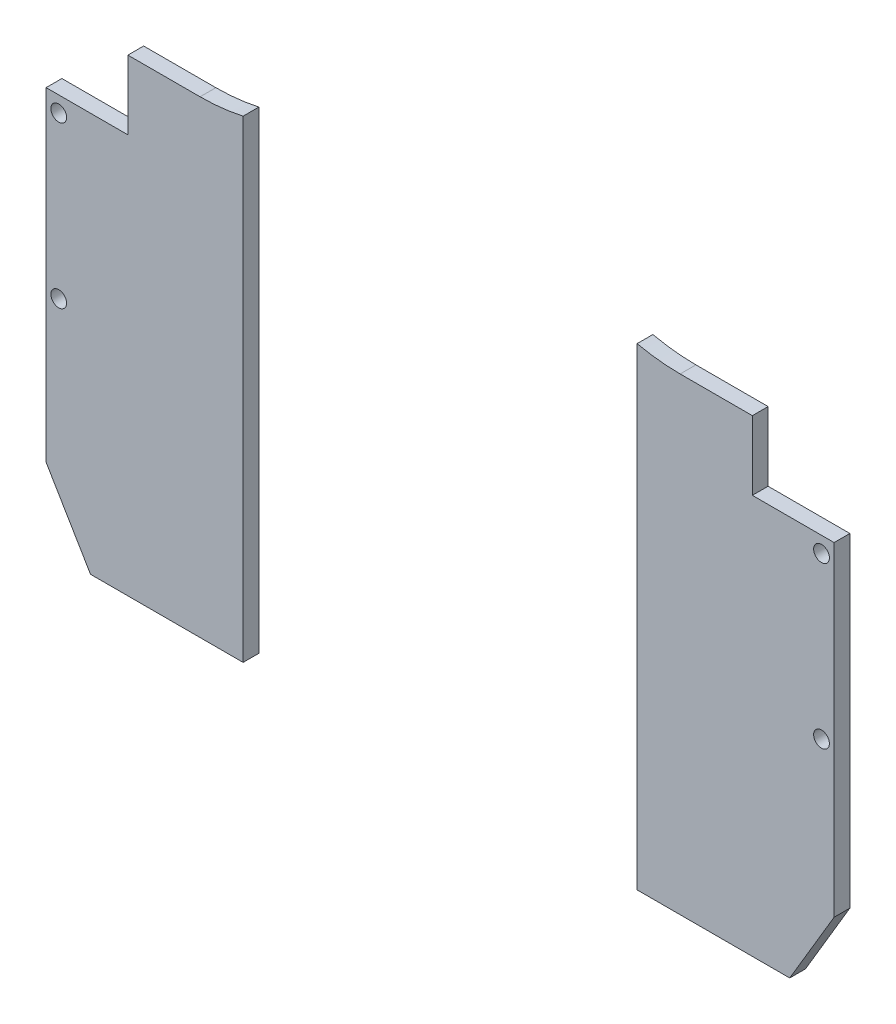
ISO-10303-21;
HEADER;
FILE_DESCRIPTION(('STEP AP214'),'2;1');
FILE_NAME('part.step','',(''),(''),'','','');
FILE_SCHEMA(('AUTOMOTIVE_DESIGN { 1 0 10303 214 1 1 1 1 }'));
ENDSEC;
DATA;
#1=APPLICATION_CONTEXT('core data for automotive mechanical design processes');
#2=APPLICATION_PROTOCOL_DEFINITION('international standard','automotive_design',2000,#1);
#3=PRODUCT_CONTEXT('',#1,'mechanical');
#4=PRODUCT('Part','Part','',(#3));
#5=PRODUCT_RELATED_PRODUCT_CATEGORY('part','',(#4));
#6=PRODUCT_DEFINITION_FORMATION('','',#4);
#7=PRODUCT_DEFINITION_CONTEXT('part definition',#1,'design');
#8=PRODUCT_DEFINITION('design','',#6,#7);
#9=PRODUCT_DEFINITION_SHAPE('','',#8);
#10=(LENGTH_UNIT() NAMED_UNIT(*) SI_UNIT(.MILLI.,.METRE.));
#11=(NAMED_UNIT(*) PLANE_ANGLE_UNIT() SI_UNIT($,.RADIAN.));
#12=(NAMED_UNIT(*) SI_UNIT($,.STERADIAN.) SOLID_ANGLE_UNIT());
#13=UNCERTAINTY_MEASURE_WITH_UNIT(LENGTH_MEASURE(1.E-05),#10,'distance_accuracy_value','');
#14=(GEOMETRIC_REPRESENTATION_CONTEXT(3) GLOBAL_UNCERTAINTY_ASSIGNED_CONTEXT((#13)) GLOBAL_UNIT_ASSIGNED_CONTEXT((#10,
#11,#12)) REPRESENTATION_CONTEXT('',''));
#15=CARTESIAN_POINT('',(0.,0.,0.));
#16=DIRECTION('',(0.,0.,1.));
#17=DIRECTION('',(1.,0.,0.));
#18=AXIS2_PLACEMENT_3D('',#15,#16,#17);
#19=CARTESIAN_POINT('',(0.,0.,5.));
#20=DIRECTION('',(0.,0.,1.));
#21=DIRECTION('',(1.,0.,0.));
#22=AXIS2_PLACEMENT_3D('',#19,#20,#21);
#23=PLANE('',#22);
#24=DIRECTION('',(0.,1.,0.));
#25=VECTOR('',#24,1.);
#26=CARTESIAN_POINT('',(-3305.54194954562,-66.9191820934981,5.));
#27=LINE('',#26,#25);
#28=CARTESIAN_POINT('',(-3305.54194954562,-288.004845850017,5.));
#29=VERTEX_POINT('',#28);
#30=CARTESIAN_POINT('',(-3305.54194954562,-137.908903834425,5.));
#31=VERTEX_POINT('',#30);
#32=EDGE_CURVE('E51',#29,#31,#27,.T.);
#33=ORIENTED_EDGE('',*,*,#32,.F.);
#34=DIRECTION('',(1.,0.,0.));
#35=VECTOR('',#34,1.);
#36=CARTESIAN_POINT('',(-3493.04194954562,-288.004845850017,5.));
#37=LINE('',#36,#35);
#38=CARTESIAN_POINT('',(-3257.12544648731,-288.004845850017,5.));
#39=VERTEX_POINT('',#38);
#40=EDGE_CURVE('E147',#29,#39,#37,.T.);
#41=ORIENTED_EDGE('',*,*,#40,.T.);
#42=DIRECTION('',(-0.510309234892407,-0.859990979477998,0.));
#43=VECTOR('',#42,1.);
#44=CARTESIAN_POINT('',(-3243.04194954562,-264.270843991495,5.));
#45=LINE('',#44,#43);
#46=CARTESIAN_POINT('',(-3243.04194954562,-264.270843991495,5.));
#47=VERTEX_POINT('',#46);
#48=EDGE_CURVE('E137',#47,#39,#45,.T.);
#49=ORIENTED_EDGE('',*,*,#48,.F.);
#50=DIRECTION('',(0.,1.,0.));
#51=VECTOR('',#50,1.);
#52=CARTESIAN_POINT('',(-3243.04194954562,-66.9191820934981,5.));
#53=LINE('',#52,#51);
#54=CARTESIAN_POINT('',(-3243.04194954562,-161.319182093498,5.));
#55=VERTEX_POINT('',#54);
#56=EDGE_CURVE('E148',#47,#55,#53,.T.);
#57=ORIENTED_EDGE('',*,*,#56,.T.);
#58=DIRECTION('',(1.,0.,0.));
#59=VECTOR('',#58,1.);
#60=CARTESIAN_POINT('',(-3243.04194954562,-161.319182093498,5.));
#61=LINE('',#60,#59);
#62=CARTESIAN_POINT('',(-3268.98194954562,-161.319182093498,5.));
#63=VERTEX_POINT('',#62);
#64=EDGE_CURVE('E168',#63,#55,#61,.T.);
#65=ORIENTED_EDGE('',*,*,#64,.F.);
#66=DIRECTION('',(0.,-1.,0.));
#67=VECTOR('',#66,1.);
#68=CARTESIAN_POINT('',(-3268.98194954562,-161.319182093498,5.));
#69=LINE('',#68,#67);
#70=CARTESIAN_POINT('',(-3268.98194954562,-139.419182093498,5.));
#71=VERTEX_POINT('',#70);
#72=EDGE_CURVE('E165',#71,#63,#69,.T.);
#73=ORIENTED_EDGE('',*,*,#72,.F.);
#74=DIRECTION('',(1.,0.,0.));
#75=VECTOR('',#74,1.);
#76=CARTESIAN_POINT('',(-3268.98194954562,-139.419182093498,5.));
#77=LINE('',#76,#75);
#78=CARTESIAN_POINT('',(-3291.88530859829,-139.419182093498,5.));
#79=VERTEX_POINT('',#78);
#80=EDGE_CURVE('E120',#79,#71,#77,.T.);
#81=ORIENTED_EDGE('',*,*,#80,.F.);
#82=CARTESIAN_POINT('',(-3291.88530859829,-76.9191820934981,5.));
#83=DIRECTION('',(0.,0.,1.));
#84=DIRECTION('',(-1.,0.,0.));
#85=AXIS2_PLACEMENT_3D('',#82,#83,#84);
#86=CIRCLE('',#85,62.4999999999999);
#87=EDGE_CURVE('E114',#31,#79,#86,.T.);
#88=ORIENTED_EDGE('',*,*,#87,.F.);
#89=EDGE_LOOP('',(#33,#41,#49,#57,#65,#73,#81,#88));
#90=FACE_BOUND('',#89,.T.);
#91=CARTESIAN_POINT('',(-3247.04194954562,-217.319182093498,5.));
#92=DIRECTION('',(0.,0.,1.));
#93=DIRECTION('',(-1.,0.,0.));
#94=AXIS2_PLACEMENT_3D('',#91,#92,#93);
#95=CIRCLE('',#94,2.50000000000012);
#96=CARTESIAN_POINT('',(-3249.54194954562,-217.319182093498,5.));
#97=VERTEX_POINT('',#96);
#98=EDGE_CURVE('E122',#97,#97,#95,.T.);
#99=ORIENTED_EDGE('',*,*,#98,.F.);
#100=EDGE_LOOP('',(#99));
#101=FACE_BOUND('',#100,.T.);
#102=CARTESIAN_POINT('',(-3247.04194954562,-166.319182093498,5.));
#103=DIRECTION('',(0.,0.,1.));
#104=DIRECTION('',(-1.,0.,0.));
#105=AXIS2_PLACEMENT_3D('',#102,#103,#104);
#106=CIRCLE('',#105,2.50000000000012);
#107=CARTESIAN_POINT('',(-3249.54194954562,-166.319182093498,5.));
#108=VERTEX_POINT('',#107);
#109=EDGE_CURVE('E126',#108,#108,#106,.T.);
#110=ORIENTED_EDGE('',*,*,#109,.F.);
#111=EDGE_LOOP('',(#110));
#112=FACE_BOUND('',#111,.T.);
#113=ADVANCED_FACE('F43',(#90,#101,#112),#23,.T.);
#114=CARTESIAN_POINT('',(0.,0.,0.));
#115=DIRECTION('',(0.,0.,1.));
#116=DIRECTION('',(1.,0.,0.));
#117=AXIS2_PLACEMENT_3D('',#114,#115,#116);
#118=PLANE('',#117);
#119=CARTESIAN_POINT('',(-3247.04194954562,-166.319182093498,0.));
#120=DIRECTION('',(0.,0.,1.));
#121=DIRECTION('',(-1.,0.,0.));
#122=AXIS2_PLACEMENT_3D('',#119,#120,#121);
#123=CIRCLE('',#122,2.50000000000012);
#124=CARTESIAN_POINT('',(-3249.54194954562,-166.319182093498,0.));
#125=VERTEX_POINT('',#124);
#126=EDGE_CURVE('E151',#125,#125,#123,.T.);
#127=ORIENTED_EDGE('',*,*,#126,.T.);
#128=EDGE_LOOP('',(#127));
#129=FACE_BOUND('',#128,.T.);
#130=CARTESIAN_POINT('',(-3247.04194954562,-217.319182093498,0.));
#131=DIRECTION('',(0.,0.,1.));
#132=DIRECTION('',(-1.,0.,0.));
#133=AXIS2_PLACEMENT_3D('',#130,#131,#132);
#134=CIRCLE('',#133,2.50000000000012);
#135=CARTESIAN_POINT('',(-3249.54194954562,-217.319182093498,0.));
#136=VERTEX_POINT('',#135);
#137=EDGE_CURVE('E146',#136,#136,#134,.T.);
#138=ORIENTED_EDGE('',*,*,#137,.T.);
#139=EDGE_LOOP('',(#138));
#140=FACE_BOUND('',#139,.T.);
#141=DIRECTION('',(1.,0.,0.));
#142=VECTOR('',#141,1.);
#143=CARTESIAN_POINT('',(-3493.04194954562,-288.004845850017,0.));
#144=LINE('',#143,#142);
#145=CARTESIAN_POINT('',(-3305.54194954562,-288.004845850017,0.));
#146=VERTEX_POINT('',#145);
#147=CARTESIAN_POINT('',(-3257.12544648731,-288.004845850017,0.));
#148=VERTEX_POINT('',#147);
#149=EDGE_CURVE('E46',#146,#148,#144,.T.);
#150=ORIENTED_EDGE('',*,*,#149,.F.);
#151=DIRECTION('',(0.,1.,0.));
#152=VECTOR('',#151,1.);
#153=CARTESIAN_POINT('',(-3305.54194954562,-66.9191820934981,0.));
#154=LINE('',#153,#152);
#155=CARTESIAN_POINT('',(-3305.54194954562,-137.908903834425,0.));
#156=VERTEX_POINT('',#155);
#157=EDGE_CURVE('E63',#146,#156,#154,.T.);
#158=ORIENTED_EDGE('',*,*,#157,.T.);
#159=CARTESIAN_POINT('',(-3291.88530859829,-76.9191820934981,0.));
#160=DIRECTION('',(0.,0.,1.));
#161=DIRECTION('',(-1.,0.,0.));
#162=AXIS2_PLACEMENT_3D('',#159,#160,#161);
#163=CIRCLE('',#162,62.4999999999999);
#164=CARTESIAN_POINT('',(-3291.88530859829,-139.419182093498,0.));
#165=VERTEX_POINT('',#164);
#166=EDGE_CURVE('E116',#156,#165,#163,.T.);
#167=ORIENTED_EDGE('',*,*,#166,.T.);
#168=DIRECTION('',(1.,0.,0.));
#169=VECTOR('',#168,1.);
#170=CARTESIAN_POINT('',(-3268.98194954562,-139.419182093498,0.));
#171=LINE('',#170,#169);
#172=CARTESIAN_POINT('',(-3268.98194954562,-139.419182093498,0.));
#173=VERTEX_POINT('',#172);
#174=EDGE_CURVE('E175',#165,#173,#171,.T.);
#175=ORIENTED_EDGE('',*,*,#174,.T.);
#176=DIRECTION('',(0.,-1.,0.));
#177=VECTOR('',#176,1.);
#178=CARTESIAN_POINT('',(-3268.98194954562,-161.319182093498,0.));
#179=LINE('',#178,#177);
#180=CARTESIAN_POINT('',(-3268.98194954562,-161.319182093498,0.));
#181=VERTEX_POINT('',#180);
#182=EDGE_CURVE('E172',#173,#181,#179,.T.);
#183=ORIENTED_EDGE('',*,*,#182,.T.);
#184=DIRECTION('',(1.,0.,0.));
#185=VECTOR('',#184,1.);
#186=CARTESIAN_POINT('',(-3243.04194954562,-161.319182093498,0.));
#187=LINE('',#186,#185);
#188=CARTESIAN_POINT('',(-3243.04194954562,-161.319182093498,0.));
#189=VERTEX_POINT('',#188);
#190=EDGE_CURVE('E141',#181,#189,#187,.T.);
#191=ORIENTED_EDGE('',*,*,#190,.T.);
#192=DIRECTION('',(0.,1.,0.));
#193=VECTOR('',#192,1.);
#194=CARTESIAN_POINT('',(-3243.04194954562,-66.9191820934981,0.));
#195=LINE('',#194,#193);
#196=CARTESIAN_POINT('',(-3243.04194954562,-264.270843991495,0.));
#197=VERTEX_POINT('',#196);
#198=EDGE_CURVE('E134',#197,#189,#195,.T.);
#199=ORIENTED_EDGE('',*,*,#198,.F.);
#200=DIRECTION('',(-0.510309234892407,-0.859990979477998,0.));
#201=VECTOR('',#200,1.);
#202=CARTESIAN_POINT('',(-3243.04194954562,-264.270843991495,0.));
#203=LINE('',#202,#201);
#204=EDGE_CURVE('E138',#197,#148,#203,.T.);
#205=ORIENTED_EDGE('',*,*,#204,.T.);
#206=EDGE_LOOP('',(#150,#158,#167,#175,#183,#191,#199,#205));
#207=FACE_BOUND('',#206,.T.);
#208=ADVANCED_FACE('F192',(#129,#140,#207),#118,.F.);
#209=CARTESIAN_POINT('',(-3493.04194954562,-288.004845850017,5.));
#210=DIRECTION('',(0.,1.,0.));
#211=DIRECTION('',(-1.,0.,0.));
#212=AXIS2_PLACEMENT_3D('',#209,#210,#211);
#213=PLANE('',#212);
#214=ORIENTED_EDGE('',*,*,#40,.F.);
#215=DIRECTION('',(0.,0.,-1.));
#216=VECTOR('',#215,1.);
#217=CARTESIAN_POINT('',(-3305.54194954562,-288.004845850017,5.));
#218=LINE('',#217,#216);
#219=EDGE_CURVE('E59',#29,#146,#218,.T.);
#220=ORIENTED_EDGE('',*,*,#219,.T.);
#221=ORIENTED_EDGE('',*,*,#149,.T.);
#222=DIRECTION('',(0.,0.,-1.));
#223=VECTOR('',#222,1.);
#224=CARTESIAN_POINT('',(-3257.12544648731,-288.004845850017,5.));
#225=LINE('',#224,#223);
#226=EDGE_CURVE('E108',#39,#148,#225,.T.);
#227=ORIENTED_EDGE('',*,*,#226,.F.);
#228=EDGE_LOOP('',(#214,#220,#221,#227));
#229=FACE_BOUND('',#228,.T.);
#230=ADVANCED_FACE('F209',(#229),#213,.F.);
#231=CARTESIAN_POINT('',(-3243.04194954562,-66.9191820934981,5.));
#232=DIRECTION('',(-1.,0.,0.));
#233=DIRECTION('',(0.,0.,1.));
#234=AXIS2_PLACEMENT_3D('',#231,#232,#233);
#235=PLANE('',#234);
#236=DIRECTION('',(0.,0.,-1.));
#237=VECTOR('',#236,1.);
#238=CARTESIAN_POINT('',(-3243.04194954562,-161.319182093498,5.));
#239=LINE('',#238,#237);
#240=EDGE_CURVE('E144',#55,#189,#239,.T.);
#241=ORIENTED_EDGE('',*,*,#240,.F.);
#242=ORIENTED_EDGE('',*,*,#56,.F.);
#243=DIRECTION('',(0.,0.,-1.));
#244=VECTOR('',#243,1.);
#245=CARTESIAN_POINT('',(-3243.04194954562,-264.270843991495,5.));
#246=LINE('',#245,#244);
#247=EDGE_CURVE('E131',#47,#197,#246,.T.);
#248=ORIENTED_EDGE('',*,*,#247,.T.);
#249=ORIENTED_EDGE('',*,*,#198,.T.);
#250=EDGE_LOOP('',(#241,#242,#248,#249));
#251=FACE_BOUND('',#250,.T.);
#252=ADVANCED_FACE('F214',(#251),#235,.F.);
#253=CARTESIAN_POINT('',(-3247.04194954562,-166.319182093498,5.));
#254=DIRECTION('',(0.,0.,-1.));
#255=DIRECTION('',(-1.,0.,0.));
#256=AXIS2_PLACEMENT_3D('',#253,#254,#255);
#257=CYLINDRICAL_SURFACE('',#256,2.50000000000012);
#258=ORIENTED_EDGE('',*,*,#109,.T.);
#259=EDGE_LOOP('',(#258));
#260=FACE_BOUND('',#259,.T.);
#261=ORIENTED_EDGE('',*,*,#126,.F.);
#262=EDGE_LOOP('',(#261));
#263=FACE_BOUND('',#262,.T.);
#264=ADVANCED_FACE('F265',(#260,#263),#257,.F.);
#265=CARTESIAN_POINT('',(-3247.04194954562,-217.319182093498,5.));
#266=DIRECTION('',(0.,0.,-1.));
#267=DIRECTION('',(-1.,0.,0.));
#268=AXIS2_PLACEMENT_3D('',#265,#266,#267);
#269=CYLINDRICAL_SURFACE('',#268,2.50000000000012);
#270=ORIENTED_EDGE('',*,*,#98,.T.);
#271=EDGE_LOOP('',(#270));
#272=FACE_BOUND('',#271,.T.);
#273=ORIENTED_EDGE('',*,*,#137,.F.);
#274=EDGE_LOOP('',(#273));
#275=FACE_BOUND('',#274,.T.);
#276=ADVANCED_FACE('F203',(#272,#275),#269,.F.);
#277=CARTESIAN_POINT('',(-3291.88530859829,-76.9191820934981,5.));
#278=DIRECTION('',(0.,0.,-1.));
#279=DIRECTION('',(-1.,0.,0.));
#280=AXIS2_PLACEMENT_3D('',#277,#278,#279);
#281=CYLINDRICAL_SURFACE('',#280,62.4999999999999);
#282=DIRECTION('',(0.,0.,-1.));
#283=VECTOR('',#282,1.);
#284=CARTESIAN_POINT('',(-3305.54194954562,-137.908903834425,5.));
#285=LINE('',#284,#283);
#286=EDGE_CURVE('E12',#31,#156,#285,.T.);
#287=ORIENTED_EDGE('',*,*,#286,.F.);
#288=ORIENTED_EDGE('',*,*,#87,.T.);
#289=DIRECTION('',(0.,0.,-1.));
#290=VECTOR('',#289,1.);
#291=CARTESIAN_POINT('',(-3291.88530859829,-139.419182093498,5.));
#292=LINE('',#291,#290);
#293=EDGE_CURVE('E121',#79,#165,#292,.T.);
#294=ORIENTED_EDGE('',*,*,#293,.T.);
#295=ORIENTED_EDGE('',*,*,#166,.F.);
#296=EDGE_LOOP('',(#287,#288,#294,#295));
#297=FACE_BOUND('',#296,.T.);
#298=ADVANCED_FACE('F112',(#297),#281,.F.);
#299=CARTESIAN_POINT('',(-3268.98194954562,-139.419182093498,5.));
#300=DIRECTION('',(0.,1.,0.));
#301=DIRECTION('',(-1.,0.,0.));
#302=AXIS2_PLACEMENT_3D('',#299,#300,#301);
#303=PLANE('',#302);
#304=ORIENTED_EDGE('',*,*,#174,.F.);
#305=ORIENTED_EDGE('',*,*,#293,.F.);
#306=ORIENTED_EDGE('',*,*,#80,.T.);
#307=DIRECTION('',(0.,0.,-1.));
#308=VECTOR('',#307,1.);
#309=CARTESIAN_POINT('',(-3268.98194954562,-139.419182093498,5.));
#310=LINE('',#309,#308);
#311=EDGE_CURVE('E163',#71,#173,#310,.T.);
#312=ORIENTED_EDGE('',*,*,#311,.T.);
#313=EDGE_LOOP('',(#304,#305,#306,#312));
#314=FACE_BOUND('',#313,.T.);
#315=ADVANCED_FACE('F195',(#314),#303,.T.);
#316=CARTESIAN_POINT('',(-3268.98194954562,-161.319182093498,5.));
#317=DIRECTION('',(1.,0.,0.));
#318=DIRECTION('',(0.,0.,-1.));
#319=AXIS2_PLACEMENT_3D('',#316,#317,#318);
#320=PLANE('',#319);
#321=ORIENTED_EDGE('',*,*,#182,.F.);
#322=ORIENTED_EDGE('',*,*,#311,.F.);
#323=ORIENTED_EDGE('',*,*,#72,.T.);
#324=DIRECTION('',(0.,0.,-1.));
#325=VECTOR('',#324,1.);
#326=CARTESIAN_POINT('',(-3268.98194954562,-161.319182093498,5.));
#327=LINE('',#326,#325);
#328=EDGE_CURVE('E166',#63,#181,#327,.T.);
#329=ORIENTED_EDGE('',*,*,#328,.T.);
#330=EDGE_LOOP('',(#321,#322,#323,#329));
#331=FACE_BOUND('',#330,.T.);
#332=ADVANCED_FACE('F183',(#331),#320,.T.);
#333=CARTESIAN_POINT('',(-3243.04194954562,-161.319182093498,5.));
#334=DIRECTION('',(0.,1.,0.));
#335=DIRECTION('',(-1.,0.,0.));
#336=AXIS2_PLACEMENT_3D('',#333,#334,#335);
#337=PLANE('',#336);
#338=ORIENTED_EDGE('',*,*,#190,.F.);
#339=ORIENTED_EDGE('',*,*,#328,.F.);
#340=ORIENTED_EDGE('',*,*,#64,.T.);
#341=ORIENTED_EDGE('',*,*,#240,.T.);
#342=EDGE_LOOP('',(#338,#339,#340,#341));
#343=FACE_BOUND('',#342,.T.);
#344=ADVANCED_FACE('F186',(#343),#337,.T.);
#345=CARTESIAN_POINT('',(-3243.04194954562,-264.270843991495,5.));
#346=DIRECTION('',(0.859990979477998,-0.510309234892407,0.));
#347=DIRECTION('',(0.510309234892407,0.859990979477998,0.));
#348=AXIS2_PLACEMENT_3D('',#345,#346,#347);
#349=PLANE('',#348);
#350=ORIENTED_EDGE('',*,*,#204,.F.);
#351=ORIENTED_EDGE('',*,*,#247,.F.);
#352=ORIENTED_EDGE('',*,*,#48,.T.);
#353=ORIENTED_EDGE('',*,*,#226,.T.);
#354=EDGE_LOOP('',(#350,#351,#352,#353));
#355=FACE_BOUND('',#354,.T.);
#356=ADVANCED_FACE('F221',(#355),#349,.T.);
#357=CARTESIAN_POINT('',(-3305.54194954562,-66.9191820934981,0.));
#358=DIRECTION('',(1.,0.,0.));
#359=DIRECTION('',(0.,1.,0.));
#360=AXIS2_PLACEMENT_3D('',#357,#358,#359);
#361=PLANE('',#360);
#362=ORIENTED_EDGE('',*,*,#32,.T.);
#363=ORIENTED_EDGE('',*,*,#286,.T.);
#364=ORIENTED_EDGE('',*,*,#157,.F.);
#365=ORIENTED_EDGE('',*,*,#219,.F.);
#366=EDGE_LOOP('',(#362,#363,#364,#365));
#367=FACE_BOUND('',#366,.T.);
#368=ADVANCED_FACE('F104',(#367),#361,.F.);
#369=CLOSED_SHELL('',(#113,#208,#230,#252,#264,#276,#298,#315,#332,#344,#356,#368));
#370=MANIFOLD_SOLID_BREP('B2',#369);
#371=CARTESIAN_POINT('',(-3467.10194954562,-161.319182093498,5.));
#372=DIRECTION('',(-1.,0.,0.));
#373=DIRECTION('',(0.,0.,1.));
#374=AXIS2_PLACEMENT_3D('',#371,#372,#373);
#375=PLANE('',#374);
#376=DIRECTION('',(0.,1.,0.));
#377=VECTOR('',#376,1.);
#378=CARTESIAN_POINT('',(-3467.10194954562,-161.319182093498,0.));
#379=LINE('',#378,#377);
#380=CARTESIAN_POINT('',(-3467.10194954562,-161.319182093498,0.));
#381=VERTEX_POINT('',#380);
#382=CARTESIAN_POINT('',(-3467.10194954562,-139.419182093498,0.));
#383=VERTEX_POINT('',#382);
#384=EDGE_CURVE('E407',#381,#383,#379,.T.);
#385=ORIENTED_EDGE('',*,*,#384,.F.);
#386=DIRECTION('',(0.,0.,-1.));
#387=VECTOR('',#386,1.);
#388=CARTESIAN_POINT('',(-3467.10194954562,-161.319182093498,5.));
#389=LINE('',#388,#387);
#390=CARTESIAN_POINT('',(-3467.10194954562,-161.319182093498,5.));
#391=VERTEX_POINT('',#390);
#392=EDGE_CURVE('E420',#391,#381,#389,.T.);
#393=ORIENTED_EDGE('',*,*,#392,.F.);
#394=DIRECTION('',(0.,1.,0.));
#395=VECTOR('',#394,1.);
#396=CARTESIAN_POINT('',(-3467.10194954562,-161.319182093498,5.));
#397=LINE('',#396,#395);
#398=CARTESIAN_POINT('',(-3467.10194954562,-139.419182093498,5.));
#399=VERTEX_POINT('',#398);
#400=EDGE_CURVE('E400',#391,#399,#397,.T.);
#401=ORIENTED_EDGE('',*,*,#400,.T.);
#402=DIRECTION('',(0.,0.,-1.));
#403=VECTOR('',#402,1.);
#404=CARTESIAN_POINT('',(-3467.10194954562,-139.419182093498,5.));
#405=LINE('',#404,#403);
#406=EDGE_CURVE('E418',#399,#383,#405,.T.);
#407=ORIENTED_EDGE('',*,*,#406,.T.);
#408=EDGE_LOOP('',(#385,#393,#401,#407));
#409=FACE_BOUND('',#408,.T.);
#410=ADVANCED_FACE('F313',(#409),#375,.T.);
#411=CARTESIAN_POINT('',(-3493.04194954562,-161.319182093498,5.));
#412=DIRECTION('',(0.,1.,0.));
#413=DIRECTION('',(0.,0.,1.));
#414=AXIS2_PLACEMENT_3D('',#411,#412,#413);
#415=PLANE('',#414);
#416=DIRECTION('',(1.,0.,0.));
#417=VECTOR('',#416,1.);
#418=CARTESIAN_POINT('',(-3493.04194954562,-161.319182093498,0.));
#419=LINE('',#418,#417);
#420=CARTESIAN_POINT('',(-3493.04194954562,-161.319182093498,0.));
#421=VERTEX_POINT('',#420);
#422=EDGE_CURVE('E404',#421,#381,#419,.T.);
#423=ORIENTED_EDGE('',*,*,#422,.F.);
#424=DIRECTION('',(0.,0.,-1.));
#425=VECTOR('',#424,1.);
#426=CARTESIAN_POINT('',(-3493.04194954562,-161.319182093498,5.));
#427=LINE('',#426,#425);
#428=CARTESIAN_POINT('',(-3493.04194954562,-161.319182093498,5.));
#429=VERTEX_POINT('',#428);
#430=EDGE_CURVE('E395',#429,#421,#427,.T.);
#431=ORIENTED_EDGE('',*,*,#430,.F.);
#432=DIRECTION('',(1.,0.,0.));
#433=VECTOR('',#432,1.);
#434=CARTESIAN_POINT('',(-3493.04194954562,-161.319182093498,5.));
#435=LINE('',#434,#433);
#436=EDGE_CURVE('E415',#429,#391,#435,.T.);
#437=ORIENTED_EDGE('',*,*,#436,.T.);
#438=ORIENTED_EDGE('',*,*,#392,.T.);
#439=EDGE_LOOP('',(#423,#431,#437,#438));
#440=FACE_BOUND('',#439,.T.);
#441=ADVANCED_FACE('F468',(#440),#415,.T.);
#442=CARTESIAN_POINT('',(-3493.04194954562,-66.9191820934982,5.));
#443=DIRECTION('',(1.,0.,0.));
#444=DIRECTION('',(0.,0.,-1.));
#445=AXIS2_PLACEMENT_3D('',#442,#443,#444);
#446=PLANE('',#445);
#447=DIRECTION('',(0.,0.,-1.));
#448=VECTOR('',#447,1.);
#449=CARTESIAN_POINT('',(-3493.04194954562,-264.270843991495,5.));
#450=LINE('',#449,#448);
#451=CARTESIAN_POINT('',(-3493.04194954562,-264.270843991495,5.));
#452=VERTEX_POINT('',#451);
#453=CARTESIAN_POINT('',(-3493.04194954562,-264.270843991495,0.));
#454=VERTEX_POINT('',#453);
#455=EDGE_CURVE('E455',#452,#454,#450,.T.);
#456=ORIENTED_EDGE('',*,*,#455,.F.);
#457=DIRECTION('',(0.,-1.,0.));
#458=VECTOR('',#457,1.);
#459=CARTESIAN_POINT('',(-3493.04194954562,-66.9191820934982,5.));
#460=LINE('',#459,#458);
#461=EDGE_CURVE('E436',#429,#452,#460,.T.);
#462=ORIENTED_EDGE('',*,*,#461,.F.);
#463=ORIENTED_EDGE('',*,*,#430,.T.);
#464=DIRECTION('',(0.,-1.,0.));
#465=VECTOR('',#464,1.);
#466=CARTESIAN_POINT('',(-3493.04194954562,-66.9191820934982,0.));
#467=LINE('',#466,#465);
#468=EDGE_CURVE('E433',#421,#454,#467,.T.);
#469=ORIENTED_EDGE('',*,*,#468,.T.);
#470=EDGE_LOOP('',(#456,#462,#463,#469));
#471=FACE_BOUND('',#470,.T.);
#472=ADVANCED_FACE('F315',(#471),#446,.F.);
#473=CARTESIAN_POINT('',(-3489.04194954562,-217.319182093498,5.));
#474=DIRECTION('',(0.,0.,-1.));
#475=DIRECTION('',(-1.,0.,0.));
#476=AXIS2_PLACEMENT_3D('',#473,#474,#475);
#477=CYLINDRICAL_SURFACE('',#476,2.50000000000012);
#478=CARTESIAN_POINT('',(-3489.04194954562,-217.319182093498,5.));
#479=DIRECTION('',(0.,0.,1.));
#480=DIRECTION('',(1.,0.,0.));
#481=AXIS2_PLACEMENT_3D('',#478,#479,#480);
#482=CIRCLE('',#481,2.50000000000012);
#483=CARTESIAN_POINT('',(-3486.54194954562,-217.319182093498,5.));
#484=VERTEX_POINT('',#483);
#485=EDGE_CURVE('E430',#484,#484,#482,.T.);
#486=ORIENTED_EDGE('',*,*,#485,.T.);
#487=EDGE_LOOP('',(#486));
#488=FACE_BOUND('',#487,.T.);
#489=CARTESIAN_POINT('',(-3489.04194954562,-217.319182093498,0.));
#490=DIRECTION('',(0.,0.,1.));
#491=DIRECTION('',(1.,0.,0.));
#492=AXIS2_PLACEMENT_3D('',#489,#490,#491);
#493=CIRCLE('',#492,2.50000000000012);
#494=CARTESIAN_POINT('',(-3486.54194954562,-217.319182093498,0.));
#495=VERTEX_POINT('',#494);
#496=EDGE_CURVE('E427',#495,#495,#493,.T.);
#497=ORIENTED_EDGE('',*,*,#496,.F.);
#498=EDGE_LOOP('',(#497));
#499=FACE_BOUND('',#498,.T.);
#500=ADVANCED_FACE('F481',(#488,#499),#477,.F.);
#501=CARTESIAN_POINT('',(-3489.04194954562,-166.319182093498,5.));
#502=DIRECTION('',(0.,0.,-1.));
#503=DIRECTION('',(-1.,0.,0.));
#504=AXIS2_PLACEMENT_3D('',#501,#502,#503);
#505=CYLINDRICAL_SURFACE('',#504,2.50000000000012);
#506=CARTESIAN_POINT('',(-3489.04194954562,-166.319182093498,5.));
#507=DIRECTION('',(0.,0.,1.));
#508=DIRECTION('',(1.,0.,0.));
#509=AXIS2_PLACEMENT_3D('',#506,#507,#508);
#510=CIRCLE('',#509,2.50000000000012);
#511=CARTESIAN_POINT('',(-3486.54194954562,-166.319182093498,5.));
#512=VERTEX_POINT('',#511);
#513=EDGE_CURVE('E424',#512,#512,#510,.T.);
#514=ORIENTED_EDGE('',*,*,#513,.T.);
#515=EDGE_LOOP('',(#514));
#516=FACE_BOUND('',#515,.T.);
#517=CARTESIAN_POINT('',(-3489.04194954562,-166.319182093498,0.));
#518=DIRECTION('',(0.,0.,1.));
#519=DIRECTION('',(1.,0.,0.));
#520=AXIS2_PLACEMENT_3D('',#517,#518,#519);
#521=CIRCLE('',#520,2.50000000000012);
#522=CARTESIAN_POINT('',(-3486.54194954562,-166.319182093498,0.));
#523=VERTEX_POINT('',#522);
#524=EDGE_CURVE('E423',#523,#523,#521,.T.);
#525=ORIENTED_EDGE('',*,*,#524,.F.);
#526=EDGE_LOOP('',(#525));
#527=FACE_BOUND('',#526,.T.);
#528=ADVANCED_FACE('F474',(#516,#527),#505,.F.);
#529=CARTESIAN_POINT('',(-3493.04194954562,-264.270843991495,5.));
#530=DIRECTION('',(-0.859990979477998,-0.510309234892407,0.));
#531=DIRECTION('',(0.510309234892407,-0.859990979477998,0.));
#532=AXIS2_PLACEMENT_3D('',#529,#530,#531);
#533=PLANE('',#532);
#534=DIRECTION('',(-0.510309234892407,0.859990979477998,0.));
#535=VECTOR('',#534,1.);
#536=CARTESIAN_POINT('',(-3493.04194954562,-264.270843991495,0.));
#537=LINE('',#536,#535);
#538=CARTESIAN_POINT('',(-3478.95845260393,-288.004845850017,0.));
#539=VERTEX_POINT('',#538);
#540=EDGE_CURVE('E335',#539,#454,#537,.T.);
#541=ORIENTED_EDGE('',*,*,#540,.F.);
#542=DIRECTION('',(0.,0.,-1.));
#543=VECTOR('',#542,1.);
#544=CARTESIAN_POINT('',(-3478.95845260393,-288.004845850017,5.));
#545=LINE('',#544,#543);
#546=CARTESIAN_POINT('',(-3478.95845260393,-288.004845850017,5.));
#547=VERTEX_POINT('',#546);
#548=EDGE_CURVE('E408',#547,#539,#545,.T.);
#549=ORIENTED_EDGE('',*,*,#548,.F.);
#550=DIRECTION('',(-0.510309234892407,0.859990979477998,0.));
#551=VECTOR('',#550,1.);
#552=CARTESIAN_POINT('',(-3493.04194954562,-264.270843991495,5.));
#553=LINE('',#552,#551);
#554=EDGE_CURVE('E453',#547,#452,#553,.T.);
#555=ORIENTED_EDGE('',*,*,#554,.T.);
#556=ORIENTED_EDGE('',*,*,#455,.T.);
#557=EDGE_LOOP('',(#541,#549,#555,#556));
#558=FACE_BOUND('',#557,.T.);
#559=ADVANCED_FACE('F472',(#558),#533,.T.);
#560=CARTESIAN_POINT('',(-3467.10194954562,-139.419182093498,5.));
#561=DIRECTION('',(0.,1.,0.));
#562=DIRECTION('',(-1.,0.,0.));
#563=AXIS2_PLACEMENT_3D('',#560,#561,#562);
#564=PLANE('',#563);
#565=DIRECTION('',(1.,0.,0.));
#566=VECTOR('',#565,1.);
#567=CARTESIAN_POINT('',(-3467.10194954562,-139.419182093498,0.));
#568=LINE('',#567,#566);
#569=CARTESIAN_POINT('',(-3444.19859049295,-139.419182093498,0.));
#570=VERTEX_POINT('',#569);
#571=EDGE_CURVE('E411',#383,#570,#568,.T.);
#572=ORIENTED_EDGE('',*,*,#571,.F.);
#573=ORIENTED_EDGE('',*,*,#406,.F.);
#574=DIRECTION('',(1.,0.,0.));
#575=VECTOR('',#574,1.);
#576=CARTESIAN_POINT('',(-3467.10194954562,-139.419182093498,5.));
#577=LINE('',#576,#575);
#578=CARTESIAN_POINT('',(-3444.19859049295,-139.419182093498,5.));
#579=VERTEX_POINT('',#578);
#580=EDGE_CURVE('E396',#399,#579,#577,.T.);
#581=ORIENTED_EDGE('',*,*,#580,.T.);
#582=DIRECTION('',(0.,0.,-1.));
#583=VECTOR('',#582,1.);
#584=CARTESIAN_POINT('',(-3444.19859049295,-139.419182093498,5.));
#585=LINE('',#584,#583);
#586=EDGE_CURVE('E394',#579,#570,#585,.T.);
#587=ORIENTED_EDGE('',*,*,#586,.T.);
#588=EDGE_LOOP('',(#572,#573,#581,#587));
#589=FACE_BOUND('',#588,.T.);
#590=ADVANCED_FACE('F466',(#589),#564,.T.);
#591=CARTESIAN_POINT('',(-3493.04194954562,-288.004845850017,5.));
#592=DIRECTION('',(0.,1.,0.));
#593=DIRECTION('',(-1.,0.,0.));
#594=AXIS2_PLACEMENT_3D('',#591,#592,#593);
#595=PLANE('',#594);
#596=DIRECTION('',(1.,0.,0.));
#597=VECTOR('',#596,1.);
#598=CARTESIAN_POINT('',(-3493.04194954562,-288.004845850017,0.));
#599=LINE('',#598,#597);
#600=CARTESIAN_POINT('',(-3430.54194954562,-288.004845850017,0.));
#601=VERTEX_POINT('',#600);
#602=EDGE_CURVE('E439',#539,#601,#599,.T.);
#603=ORIENTED_EDGE('',*,*,#602,.T.);
#604=DIRECTION('',(0.,0.,1.));
#605=VECTOR('',#604,1.);
#606=CARTESIAN_POINT('',(-3430.54194954562,-288.004845850017,5.));
#607=LINE('',#606,#605);
#608=CARTESIAN_POINT('',(-3430.54194954562,-288.004845850017,5.));
#609=VERTEX_POINT('',#608);
#610=EDGE_CURVE('E446',#601,#609,#607,.T.);
#611=ORIENTED_EDGE('',*,*,#610,.T.);
#612=DIRECTION('',(1.,0.,0.));
#613=VECTOR('',#612,1.);
#614=CARTESIAN_POINT('',(-3493.04194954562,-288.004845850017,5.));
#615=LINE('',#614,#613);
#616=EDGE_CURVE('E321',#547,#609,#615,.T.);
#617=ORIENTED_EDGE('',*,*,#616,.F.);
#618=ORIENTED_EDGE('',*,*,#548,.T.);
#619=EDGE_LOOP('',(#603,#611,#617,#618));
#620=FACE_BOUND('',#619,.T.);
#621=ADVANCED_FACE('F445',(#620),#595,.F.);
#622=CARTESIAN_POINT('',(-3444.19859049295,-76.9191820934982,5.));
#623=DIRECTION('',(0.,0.,-1.));
#624=DIRECTION('',(-1.,0.,0.));
#625=AXIS2_PLACEMENT_3D('',#622,#623,#624);
#626=CYLINDRICAL_SURFACE('',#625,62.4999999999999);
#627=DIRECTION('',(0.,0.,-1.));
#628=VECTOR('',#627,1.);
#629=CARTESIAN_POINT('',(-3430.54194954562,-137.908903834425,5.));
#630=LINE('',#629,#628);
#631=CARTESIAN_POINT('',(-3430.54194954562,-137.908903834425,0.));
#632=VERTEX_POINT('',#631);
#633=CARTESIAN_POINT('',(-3430.54194954562,-137.908903834425,5.));
#634=VERTEX_POINT('',#633);
#635=EDGE_CURVE('E41',#632,#634,#630,.F.);
#636=ORIENTED_EDGE('',*,*,#635,.F.);
#637=CARTESIAN_POINT('',(-3444.19859049295,-76.9191820934982,0.));
#638=DIRECTION('',(0.,0.,1.));
#639=DIRECTION('',(1.,0.,0.));
#640=AXIS2_PLACEMENT_3D('',#637,#638,#639);
#641=CIRCLE('',#640,62.4999999999999);
#642=EDGE_CURVE('E414',#570,#632,#641,.T.);
#643=ORIENTED_EDGE('',*,*,#642,.F.);
#644=ORIENTED_EDGE('',*,*,#586,.F.);
#645=CARTESIAN_POINT('',(-3444.19859049295,-76.9191820934982,5.));
#646=DIRECTION('',(0.,0.,1.));
#647=DIRECTION('',(1.,0.,0.));
#648=AXIS2_PLACEMENT_3D('',#645,#646,#647);
#649=CIRCLE('',#648,62.4999999999999);
#650=EDGE_CURVE('E388',#579,#634,#649,.T.);
#651=ORIENTED_EDGE('',*,*,#650,.T.);
#652=EDGE_LOOP('',(#636,#643,#644,#651));
#653=FACE_BOUND('',#652,.T.);
#654=ADVANCED_FACE('F393',(#653),#626,.F.);
#655=CARTESIAN_POINT('',(0.,0.,0.));
#656=DIRECTION('',(0.,0.,1.));
#657=DIRECTION('',(1.,0.,0.));
#658=AXIS2_PLACEMENT_3D('',#655,#656,#657);
#659=PLANE('',#658);
#660=ORIENTED_EDGE('',*,*,#524,.T.);
#661=EDGE_LOOP('',(#660));
#662=FACE_BOUND('',#661,.T.);
#663=ORIENTED_EDGE('',*,*,#496,.T.);
#664=EDGE_LOOP('',(#663));
#665=FACE_BOUND('',#664,.T.);
#666=ORIENTED_EDGE('',*,*,#642,.T.);
#667=DIRECTION('',(0.,-1.,0.));
#668=VECTOR('',#667,1.);
#669=CARTESIAN_POINT('',(-3430.54194954562,-66.9191820934982,0.));
#670=LINE('',#669,#668);
#671=EDGE_CURVE('E327',#632,#601,#670,.T.);
#672=ORIENTED_EDGE('',*,*,#671,.T.);
#673=ORIENTED_EDGE('',*,*,#602,.F.);
#674=ORIENTED_EDGE('',*,*,#540,.T.);
#675=ORIENTED_EDGE('',*,*,#468,.F.);
#676=ORIENTED_EDGE('',*,*,#422,.T.);
#677=ORIENTED_EDGE('',*,*,#384,.T.);
#678=ORIENTED_EDGE('',*,*,#571,.T.);
#679=EDGE_LOOP('',(#666,#672,#673,#674,#675,#676,#677,#678));
#680=FACE_BOUND('',#679,.T.);
#681=ADVANCED_FACE('F448',(#662,#665,#680),#659,.F.);
#682=CARTESIAN_POINT('',(0.,0.,5.));
#683=DIRECTION('',(0.,0.,1.));
#684=DIRECTION('',(1.,0.,0.));
#685=AXIS2_PLACEMENT_3D('',#682,#683,#684);
#686=PLANE('',#685);
#687=DIRECTION('',(0.,-1.,0.));
#688=VECTOR('',#687,1.);
#689=CARTESIAN_POINT('',(-3430.54194954562,-66.9191820934982,5.));
#690=LINE('',#689,#688);
#691=EDGE_CURVE('E376',#634,#609,#690,.T.);
#692=ORIENTED_EDGE('',*,*,#691,.F.);
#693=ORIENTED_EDGE('',*,*,#650,.F.);
#694=ORIENTED_EDGE('',*,*,#580,.F.);
#695=ORIENTED_EDGE('',*,*,#400,.F.);
#696=ORIENTED_EDGE('',*,*,#436,.F.);
#697=ORIENTED_EDGE('',*,*,#461,.T.);
#698=ORIENTED_EDGE('',*,*,#554,.F.);
#699=ORIENTED_EDGE('',*,*,#616,.T.);
#700=EDGE_LOOP('',(#692,#693,#694,#695,#696,#697,#698,#699));
#701=FACE_BOUND('',#700,.T.);
#702=ORIENTED_EDGE('',*,*,#485,.F.);
#703=EDGE_LOOP('',(#702));
#704=FACE_BOUND('',#703,.T.);
#705=ORIENTED_EDGE('',*,*,#513,.F.);
#706=EDGE_LOOP('',(#705));
#707=FACE_BOUND('',#706,.T.);
#708=ADVANCED_FACE('F385',(#701,#704,#707),#686,.T.);
#709=CARTESIAN_POINT('',(-3430.54194954562,-66.9191820934982,0.));
#710=DIRECTION('',(-1.,0.,0.));
#711=DIRECTION('',(0.,-1.,0.));
#712=AXIS2_PLACEMENT_3D('',#709,#710,#711);
#713=PLANE('',#712);
#714=ORIENTED_EDGE('',*,*,#671,.F.);
#715=ORIENTED_EDGE('',*,*,#635,.T.);
#716=ORIENTED_EDGE('',*,*,#691,.T.);
#717=ORIENTED_EDGE('',*,*,#610,.F.);
#718=EDGE_LOOP('',(#714,#715,#716,#717));
#719=FACE_BOUND('',#718,.T.);
#720=ADVANCED_FACE('F375',(#719),#713,.F.);
#721=CLOSED_SHELL('',(#410,#441,#472,#500,#528,#559,#590,#621,#654,#681,#708,#720));
#722=MANIFOLD_SOLID_BREP('B6',#721);
#723=ADVANCED_BREP_SHAPE_REPRESENTATION('',(#18,#370,#722),#14);
#724=SHAPE_DEFINITION_REPRESENTATION(#9,#723);
ENDSEC;
END-ISO-10303-21;
